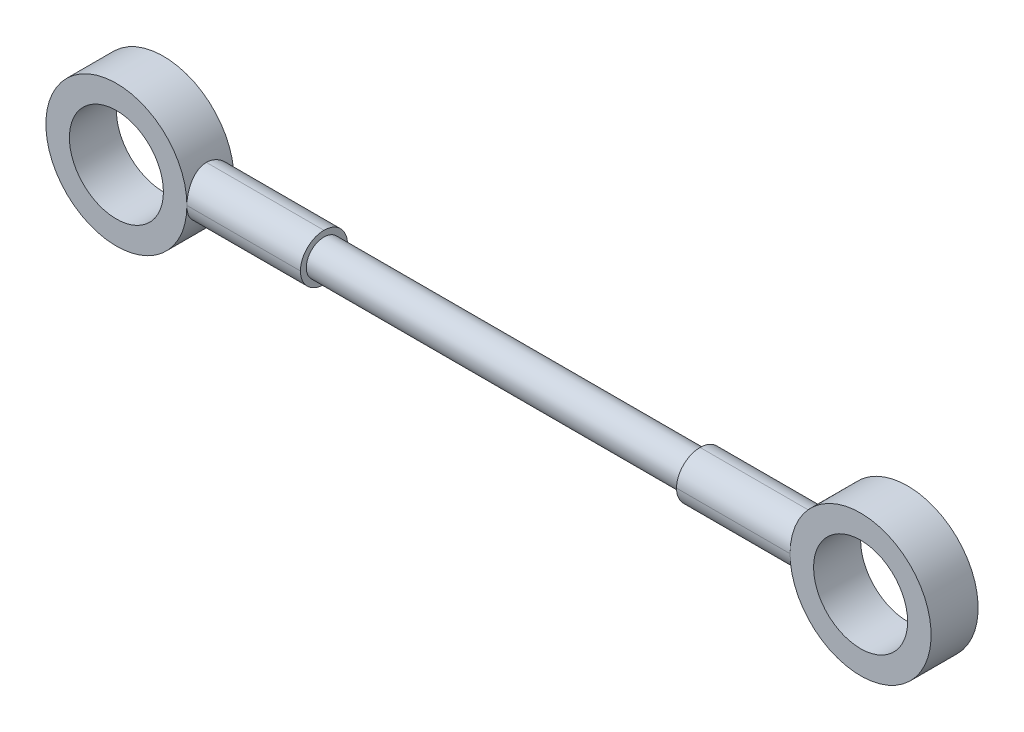
ISO-10303-21;
HEADER;
FILE_DESCRIPTION(('STEP AP214'),'2;1');
FILE_NAME('part.step','',(''),(''),'','','');
FILE_SCHEMA(('AUTOMOTIVE_DESIGN { 1 0 10303 214 1 1 1 1 }'));
ENDSEC;
DATA;
#1=APPLICATION_CONTEXT('core data for automotive mechanical design processes');
#2=APPLICATION_PROTOCOL_DEFINITION('international standard','automotive_design',2000,#1);
#3=PRODUCT_CONTEXT('',#1,'mechanical');
#4=PRODUCT('Part','Part','',(#3));
#5=PRODUCT_RELATED_PRODUCT_CATEGORY('part','',(#4));
#6=PRODUCT_DEFINITION_FORMATION('','',#4);
#7=PRODUCT_DEFINITION_CONTEXT('part definition',#1,'design');
#8=PRODUCT_DEFINITION('design','',#6,#7);
#9=PRODUCT_DEFINITION_SHAPE('','',#8);
#10=(LENGTH_UNIT() NAMED_UNIT(*) SI_UNIT(.MILLI.,.METRE.));
#11=(NAMED_UNIT(*) PLANE_ANGLE_UNIT() SI_UNIT($,.RADIAN.));
#12=(NAMED_UNIT(*) SI_UNIT($,.STERADIAN.) SOLID_ANGLE_UNIT());
#13=UNCERTAINTY_MEASURE_WITH_UNIT(LENGTH_MEASURE(1.E-05),#10,'distance_accuracy_value','');
#14=(GEOMETRIC_REPRESENTATION_CONTEXT(3) GLOBAL_UNCERTAINTY_ASSIGNED_CONTEXT((#13)) GLOBAL_UNIT_ASSIGNED_CONTEXT((#10,
#11,#12)) REPRESENTATION_CONTEXT('',''));
#15=CARTESIAN_POINT('',(0.,0.,0.));
#16=DIRECTION('',(0.,0.,1.));
#17=DIRECTION('',(1.,0.,0.));
#18=AXIS2_PLACEMENT_3D('',#15,#16,#17);
#19=CARTESIAN_POINT('',(-2.82842712474619,-1.,2.));
#20=DIRECTION('',(0.,0.,-1.));
#21=DIRECTION('',(-1.,0.,0.));
#22=AXIS2_PLACEMENT_3D('',#19,#20,#21);
#23=CYLINDRICAL_SURFACE('',#22,3.);
#24=CARTESIAN_POINT('',(-2.82842712474619,-1.,0.));
#25=DIRECTION('',(0.,0.,1.));
#26=DIRECTION('',(1.,0.,0.));
#27=AXIS2_PLACEMENT_3D('',#24,#25,#26);
#28=CIRCLE('',#27,3.);
#29=CARTESIAN_POINT('',(0.17157287525381,-1.,0.));
#30=VERTEX_POINT('',#29);
#31=EDGE_CURVE('E271',#30,#30,#28,.T.);
#32=ORIENTED_EDGE('',*,*,#31,.T.);
#33=CARTESIAN_POINT('',(0.17157287525381,-1.,0.));
#34=CARTESIAN_POINT('',(0.171574895683711,-1.0273341815832,-6.341255151472E-07));
#35=CARTESIAN_POINT('',(0.171198852653009,-1.05465458106806,0.00112146518805121));
#36=CARTESIAN_POINT('',(0.169712227509515,-1.10908622394521,0.00559256721422979));
#37=CARTESIAN_POINT('',(0.168601814056069,-1.13619751391667,0.00894105860296367));
#38=CARTESIAN_POINT('',(0.164211861163425,-1.21676717081039,0.0222664591395675));
#39=CARTESIAN_POINT('',(0.159873290123847,-1.26966401060743,0.0355236171974723));
#40=CARTESIAN_POINT('',(0.148826956569191,-1.3723325215028,0.0703168200425464));
#41=CARTESIAN_POINT('',(0.142120038917677,-1.42210529960458,0.091849912785915));
#42=CARTESIAN_POINT('',(0.127020134371075,-1.51735737488644,0.142531248358756));
#43=CARTESIAN_POINT('',(0.118626250326626,-1.56283436851799,0.171683545663462));
#44=CARTESIAN_POINT('',(0.1007142093334,-1.64974046928466,0.237824363219281));
#45=CARTESIAN_POINT('',(0.0911692651881778,-1.69100037422885,0.275027803593729));
#46=CARTESIAN_POINT('',(0.0721767808726406,-1.76682970187699,0.355763859637555));
#47=CARTESIAN_POINT('',(0.062729271088358,-1.80139709381649,0.399298389406312));
#48=CARTESIAN_POINT('',(0.0447028520329025,-1.86383672510256,0.493001776499649));
#49=CARTESIAN_POINT('',(0.0361572192253774,-1.89148486384565,0.543326827116039));
#50=CARTESIAN_POINT('',(0.0213207076682923,-1.93783407228994,0.648222653213277));
#51=CARTESIAN_POINT('',(0.0150274451238011,-1.95654460816169,0.702788865146815));
#52=CARTESIAN_POINT('',(0.00693350452697696,-1.98022444026411,0.797997384607047));
#53=CARTESIAN_POINT('',(0.00435463055334164,-1.9876210419263,0.837985516344999));
#54=CARTESIAN_POINT('',(0.000878301967788375,-1.99751591481272,0.918639741683267));
#55=CARTESIAN_POINT('',(-1.88930219856355E-05,-2.00001342970547,0.959305938987627));
#56=CARTESIAN_POINT('',(0.,-2.,1.));
#57=B_SPLINE_CURVE_WITH_KNOTS('',3,(#33,#34,#35,#36,#37,#38,#39,#40,#41,#42,#43,#44,#45,#46,#47,
#48,#49,#50,#51,#52,#53,#54,#55,#56),.UNSPECIFIED.,.F.,.F.,(4,2,2,2,2,2,2,2,2,2,2,4),(0.,
0.0819499502153417,0.163881085910289,0.327143353332599,0.490347438719014,0.653638548803994,
0.821992023758864,0.990396503807029,1.16370154745204,1.33682262759439,1.45874909491416,
1.58069438402141),.UNSPECIFIED.);
#58=CARTESIAN_POINT('',(0.,-2.,1.));
#59=VERTEX_POINT('',#58);
#60=EDGE_CURVE('E126',#30,#59,#57,.T.);
#61=ORIENTED_EDGE('',*,*,#60,.T.);
#62=CARTESIAN_POINT('',(0.,-2.,1.));
#63=CARTESIAN_POINT('',(-2.70452435684332E-06,-2.00000074756436,1.0272914781128));
#64=CARTESIAN_POINT('',(0.00039550302592743,-1.9988820440552,1.0545690248834));
#65=CARTESIAN_POINT('',(0.00196628915240177,-1.99442520677671,1.1089124836948));
#66=CARTESIAN_POINT('',(0.00313865858948704,-1.99108767242079,1.13597845089605));
#67=CARTESIAN_POINT('',(0.00776412497835064,-1.97780972353601,1.21639595058795));
#68=CARTESIAN_POINT('',(0.0123260080648277,-1.96460360313312,1.26918269340203));
#69=CARTESIAN_POINT('',(0.0238535189858551,-1.92995872747904,1.3716242745002));
#70=CARTESIAN_POINT('',(0.0308178637920714,-1.9085243658105,1.42128076777822));
#71=CARTESIAN_POINT('',(0.0463604431985569,-1.85807424130008,1.51633821762498));
#72=CARTESIAN_POINT('',(0.0549397250867303,-1.82905355394609,1.56173638387934));
#73=CARTESIAN_POINT('',(0.0731175608092314,-1.76305188825796,1.64871968071218));
#74=CARTESIAN_POINT('',(0.0827413941457665,-1.72582622035046,1.69011381458293));
#75=CARTESIAN_POINT('',(0.101711161410165,-1.64498916323806,1.76620523841994));
#76=CARTESIAN_POINT('',(0.111057038796944,-1.60137648534903,1.80090117363182));
#77=CARTESIAN_POINT('',(0.128714467347506,-1.50758974235876,1.86348941937963));
#78=CARTESIAN_POINT('',(0.136992173141851,-1.45727278199338,1.89117778867313));
#79=CARTESIAN_POINT('',(0.15127321622625,-1.35238919133199,1.93760527679002));
#80=CARTESIAN_POINT('',(0.157278696192476,-1.29782662342825,1.95635283104096));
#81=CARTESIAN_POINT('',(0.164991067433952,-1.20251996913543,1.98012275152827));
#82=CARTESIAN_POINT('',(0.167442343934031,-1.16242206859112,1.98755876778259));
#83=CARTESIAN_POINT('',(0.170740824616526,-1.08155816921847,1.99750386175675));
#84=CARTESIAN_POINT('',(0.171588097798374,-1.04079219920457,2.00001315140983));
#85=CARTESIAN_POINT('',(0.17157287525381,-1.,2.));
#86=B_SPLINE_CURVE_WITH_KNOTS('',3,(#62,#63,#64,#65,#66,#67,#68,#69,#70,#71,#72,#73,#74,#75,#76,
#77,#78,#79,#80,#81,#82,#83,#84,#85),.UNSPECIFIED.,.F.,.F.,(4,2,2,2,2,2,2,2,2,2,2,4),(0.,
0.0818214261370687,0.163620757330831,0.32658121417332,0.489454776800649,0.652434329231453,
0.82116302655375,0.989925814684785,1.16314675188847,1.33620393471117,1.45845203884751,
1.58069488411601),.UNSPECIFIED.);
#87=CARTESIAN_POINT('',(0.17157287525381,-1.,2.));
#88=VERTEX_POINT('',#87);
#89=EDGE_CURVE('E218',#59,#88,#86,.T.);
#90=ORIENTED_EDGE('',*,*,#89,.T.);
#91=CARTESIAN_POINT('',(-2.82842712474619,-1.,2.));
#92=DIRECTION('',(0.,0.,1.));
#93=DIRECTION('',(1.,0.,0.));
#94=AXIS2_PLACEMENT_3D('',#91,#92,#93);
#95=CIRCLE('',#94,3.);
#96=EDGE_CURVE('E265',#88,#88,#95,.T.);
#97=ORIENTED_EDGE('',*,*,#96,.F.);
#98=CARTESIAN_POINT('',(0.17157287525381,-1.,2.));
#99=CARTESIAN_POINT('',(0.171574895683711,-0.9726658184168,2.00000063412552));
#100=CARTESIAN_POINT('',(0.171198852653009,-0.945345418931944,1.99887853481195));
#101=CARTESIAN_POINT('',(0.169712227509516,-0.890913776054792,1.99440743278577));
#102=CARTESIAN_POINT('',(0.168601814056069,-0.863802486083335,1.99105894139704));
#103=CARTESIAN_POINT('',(0.164211861163425,-0.783232829189608,1.97773354086043));
#104=CARTESIAN_POINT('',(0.159873290123847,-0.730335989392572,1.96447638280253));
#105=CARTESIAN_POINT('',(0.148826956569191,-0.627667478497201,1.92968317995745));
#106=CARTESIAN_POINT('',(0.142120038917677,-0.577894700395424,1.90815008721409));
#107=CARTESIAN_POINT('',(0.127020134371075,-0.48264262511356,1.85746875164124));
#108=CARTESIAN_POINT('',(0.118626250326625,-0.437165631482007,1.82831645433654));
#109=CARTESIAN_POINT('',(0.100714209333399,-0.350259530715338,1.76217563678072));
#110=CARTESIAN_POINT('',(0.0911692651881778,-0.308999625771145,1.72497219640627));
#111=CARTESIAN_POINT('',(0.0721767808726406,-0.233170298123015,1.64423614036245));
#112=CARTESIAN_POINT('',(0.0627292710883576,-0.198602906183507,1.60070161059369));
#113=CARTESIAN_POINT('',(0.0447028520329021,-0.136163274897442,1.50699822350035));
#114=CARTESIAN_POINT('',(0.0361572192253773,-0.10851513615435,1.45667317288396));
#115=CARTESIAN_POINT('',(0.0213207076682922,-0.0621659277100603,1.35177734678672));
#116=CARTESIAN_POINT('',(0.0150274451238007,-0.0434553918383099,1.29721113485319));
#117=CARTESIAN_POINT('',(0.00693350452697641,-0.0197755597358865,1.20200261539295));
#118=CARTESIAN_POINT('',(0.00435463055334112,-0.0123789580736969,1.162014483655));
#119=CARTESIAN_POINT('',(0.000878301967788045,-0.00248408518727784,1.08136025831673));
#120=CARTESIAN_POINT('',(-1.8893021985806E-05,1.34297054719161E-05,1.04069406101237));
#121=CARTESIAN_POINT('',(0.,0.,1.));
#122=B_SPLINE_CURVE_WITH_KNOTS('',3,(#98,#99,#100,#101,#102,#103,#104,#105,#106,#107,#108,#109,
#110,#111,#112,#113,#114,#115,#116,#117,#118,#119,#120,#121),.UNSPECIFIED.,.F.,.F.,(4,2,2,2,2,2,
2,2,2,2,2,4),(0.,0.0819499502153415,0.163881085910288,0.327143353332599,0.490347438719014,
0.653638548803994,0.821992023758864,0.990396503807029,1.16370154745204,1.33682262759439,
1.45874909491416,1.58069438402141),.UNSPECIFIED.);
#123=CARTESIAN_POINT('',(0.,0.,1.));
#124=VERTEX_POINT('',#123);
#125=EDGE_CURVE('E139',#88,#124,#122,.T.);
#126=ORIENTED_EDGE('',*,*,#125,.T.);
#127=CARTESIAN_POINT('',(0.,0.,1.));
#128=CARTESIAN_POINT('',(-2.70452435728408E-06,7.47564359590601E-07,0.972708521887199));
#129=CARTESIAN_POINT('',(0.000395503025926949,-0.00111795594480098,0.945430975116602));
#130=CARTESIAN_POINT('',(0.00196628915240149,-0.00557479322329393,0.891087516305198));
#131=CARTESIAN_POINT('',(0.003138658589487,-0.00891232757921084,0.864021549103947));
#132=CARTESIAN_POINT('',(0.00776412497835097,-0.0221902764639867,0.783604049412054));
#133=CARTESIAN_POINT('',(0.0123260080648278,-0.0353963968668777,0.730817306597974));
#134=CARTESIAN_POINT('',(0.023853518985855,-0.0700412725209598,0.628375725499801));
#135=CARTESIAN_POINT('',(0.0308178637920713,-0.091475634189501,0.578719232221779));
#136=CARTESIAN_POINT('',(0.0463604431985568,-0.141925758699916,0.483661782375017));
#137=CARTESIAN_POINT('',(0.0549397250867303,-0.170946446053912,0.438263616120662));
#138=CARTESIAN_POINT('',(0.0731175608092314,-0.236948111742035,0.351280319287816));
#139=CARTESIAN_POINT('',(0.0827413941457665,-0.274173779649543,0.309886185417069));
#140=CARTESIAN_POINT('',(0.101711161410165,-0.355010836761935,0.233794761580061));
#141=CARTESIAN_POINT('',(0.111057038796944,-0.398623514650966,0.199098826368183));
#142=CARTESIAN_POINT('',(0.128714467347505,-0.492410257641237,0.136510580620371));
#143=CARTESIAN_POINT('',(0.136992173141851,-0.542727218006621,0.108822211326867));
#144=CARTESIAN_POINT('',(0.15127321622625,-0.64761080866801,0.0623947232099815));
#145=CARTESIAN_POINT('',(0.157278696192476,-0.702173376571753,0.0436471689590383));
#146=CARTESIAN_POINT('',(0.164991067433952,-0.797480030864567,0.0198772484717253));
#147=CARTESIAN_POINT('',(0.167442343934031,-0.837577931408877,0.0124412322174104));
#148=CARTESIAN_POINT('',(0.170740824616526,-0.918441830781532,0.00249613824325099));
#149=CARTESIAN_POINT('',(0.171588097798374,-0.959207800795427,-1.31514098298327E-05));
#150=CARTESIAN_POINT('',(0.17157287525381,-1.,0.));
#151=B_SPLINE_CURVE_WITH_KNOTS('',3,(#127,#128,#129,#130,#131,#132,#133,#134,#135,#136,#137,
#138,#139,#140,#141,#142,#143,#144,#145,#146,#147,#148,#149,#150),.UNSPECIFIED.,.F.,.F.,(4,2,2,
2,2,2,2,2,2,2,2,4),(0.,0.0818214261370686,0.163620757330831,0.32658121417332,0.489454776800649,
0.652434329231454,0.82116302655375,0.989925814684785,1.16314675188847,1.33620393471117,
1.45845203884751,1.58069488411601),.UNSPECIFIED.);
#152=EDGE_CURVE('E233',#124,#30,#151,.T.);
#153=ORIENTED_EDGE('',*,*,#152,.T.);
#154=EDGE_LOOP('',(#32,#61,#90,#97,#126,#153));
#155=FACE_BOUND('',#154,.T.);
#156=ADVANCED_FACE('F34',(#155),#23,.T.);
#157=CARTESIAN_POINT('',(5.,0.,2.));
#158=DIRECTION('',(-1.,0.,0.));
#159=DIRECTION('',(0.,0.,1.));
#160=AXIS2_PLACEMENT_3D('',#157,#158,#159);
#161=PLANE('',#160);
#162=CARTESIAN_POINT('',(5.,-1.,1.));
#163=DIRECTION('',(1.,0.,0.));
#164=DIRECTION('',(0.,0.,-1.));
#165=AXIS2_PLACEMENT_3D('',#162,#163,#164);
#166=CIRCLE('',#165,0.75);
#167=CARTESIAN_POINT('',(5.,-1.,0.25));
#168=VERTEX_POINT('',#167);
#169=EDGE_CURVE('E262',#168,#168,#166,.T.);
#170=ORIENTED_EDGE('',*,*,#169,.F.);
#171=EDGE_LOOP('',(#170));
#172=FACE_BOUND('',#171,.T.);
#173=CARTESIAN_POINT('',(5.,-1.,1.));
#174=DIRECTION('',(-1.,0.,0.));
#175=DIRECTION('',(0.,0.,1.));
#176=AXIS2_PLACEMENT_3D('',#173,#174,#175);
#177=CIRCLE('',#176,1.);
#178=CARTESIAN_POINT('',(5.,0.,1.));
#179=VERTEX_POINT('',#178);
#180=CARTESIAN_POINT('',(5.,-1.,2.));
#181=VERTEX_POINT('',#180);
#182=EDGE_CURVE('E123',#179,#181,#177,.F.);
#183=ORIENTED_EDGE('',*,*,#182,.T.);
#184=CARTESIAN_POINT('',(5.,-1.,1.));
#185=DIRECTION('',(-1.,0.,0.));
#186=DIRECTION('',(0.,0.,1.));
#187=AXIS2_PLACEMENT_3D('',#184,#185,#186);
#188=CIRCLE('',#187,1.);
#189=CARTESIAN_POINT('',(5.,-2.,1.));
#190=VERTEX_POINT('',#189);
#191=EDGE_CURVE('E109',#181,#190,#188,.F.);
#192=ORIENTED_EDGE('',*,*,#191,.T.);
#193=CARTESIAN_POINT('',(5.,-1.,1.));
#194=DIRECTION('',(-1.,0.,0.));
#195=DIRECTION('',(0.,0.,1.));
#196=AXIS2_PLACEMENT_3D('',#193,#194,#195);
#197=CIRCLE('',#196,1.);
#198=CARTESIAN_POINT('',(5.,-1.,0.));
#199=VERTEX_POINT('',#198);
#200=EDGE_CURVE('E103',#190,#199,#197,.F.);
#201=ORIENTED_EDGE('',*,*,#200,.T.);
#202=CARTESIAN_POINT('',(5.,-1.,1.));
#203=DIRECTION('',(-1.,0.,0.));
#204=DIRECTION('',(0.,0.,1.));
#205=AXIS2_PLACEMENT_3D('',#202,#203,#204);
#206=CIRCLE('',#205,1.);
#207=EDGE_CURVE('E106',#199,#179,#206,.F.);
#208=ORIENTED_EDGE('',*,*,#207,.T.);
#209=EDGE_LOOP('',(#183,#192,#201,#208));
#210=FACE_BOUND('',#209,.T.);
#211=ADVANCED_FACE('F105',(#172,#210),#161,.F.);
#212=CARTESIAN_POINT('',(-2.82842712474619,-1.,2.));
#213=DIRECTION('',(0.,0.,1.));
#214=DIRECTION('',(1.,0.,0.));
#215=AXIS2_PLACEMENT_3D('',#212,#213,#214);
#216=PLANE('',#215);
#217=CARTESIAN_POINT('',(-2.82842712474619,-1.,2.));
#218=DIRECTION('',(0.,0.,1.));
#219=DIRECTION('',(1.,0.,0.));
#220=AXIS2_PLACEMENT_3D('',#217,#218,#219);
#221=CIRCLE('',#220,2.);
#222=CARTESIAN_POINT('',(-0.82842712474619,-1.,2.));
#223=VERTEX_POINT('',#222);
#224=EDGE_CURVE('E289',#223,#223,#221,.T.);
#225=ORIENTED_EDGE('',*,*,#224,.F.);
#226=EDGE_LOOP('',(#225));
#227=FACE_BOUND('',#226,.T.);
#228=ORIENTED_EDGE('',*,*,#96,.T.);
#229=EDGE_LOOP('',(#228));
#230=FACE_BOUND('',#229,.T.);
#231=ADVANCED_FACE('F205',(#227,#230),#216,.T.);
#232=CARTESIAN_POINT('',(-2.82842712474619,-1.,0.));
#233=DIRECTION('',(0.,0.,1.));
#234=DIRECTION('',(1.,0.,0.));
#235=AXIS2_PLACEMENT_3D('',#232,#233,#234);
#236=PLANE('',#235);
#237=CARTESIAN_POINT('',(-2.82842712474619,-1.,0.));
#238=DIRECTION('',(0.,0.,1.));
#239=DIRECTION('',(1.,0.,0.));
#240=AXIS2_PLACEMENT_3D('',#237,#238,#239);
#241=CIRCLE('',#240,2.);
#242=CARTESIAN_POINT('',(-0.82842712474619,-1.,0.));
#243=VERTEX_POINT('',#242);
#244=EDGE_CURVE('E295',#243,#243,#241,.T.);
#245=ORIENTED_EDGE('',*,*,#244,.T.);
#246=EDGE_LOOP('',(#245));
#247=FACE_BOUND('',#246,.T.);
#248=ORIENTED_EDGE('',*,*,#31,.F.);
#249=EDGE_LOOP('',(#248));
#250=FACE_BOUND('',#249,.T.);
#251=ADVANCED_FACE('F302',(#247,#250),#236,.F.);
#252=CARTESIAN_POINT('',(25.,-1.,1.));
#253=DIRECTION('',(-1.,0.,0.));
#254=DIRECTION('',(0.,0.,1.));
#255=AXIS2_PLACEMENT_3D('',#252,#253,#254);
#256=CYLINDRICAL_SURFACE('',#255,0.75);
#257=CARTESIAN_POINT('',(21.,-1.,1.));
#258=DIRECTION('',(-1.,0.,0.));
#259=DIRECTION('',(0.,0.,1.));
#260=AXIS2_PLACEMENT_3D('',#257,#258,#259);
#261=CIRCLE('',#260,0.75);
#262=CARTESIAN_POINT('',(21.,-1.,1.75));
#263=VERTEX_POINT('',#262);
#264=EDGE_CURVE('E268',#263,#263,#261,.T.);
#265=ORIENTED_EDGE('',*,*,#264,.T.);
#266=EDGE_LOOP('',(#265));
#267=FACE_BOUND('',#266,.T.);
#268=ORIENTED_EDGE('',*,*,#169,.T.);
#269=EDGE_LOOP('',(#268));
#270=FACE_BOUND('',#269,.T.);
#271=ADVANCED_FACE('F306',(#267,#270),#256,.T.);
#272=CARTESIAN_POINT('',(-2.82842712474619,-1.,-18.));
#273=DIRECTION('',(0.,0.,1.));
#274=DIRECTION('',(1.,0.,0.));
#275=AXIS2_PLACEMENT_3D('',#272,#273,#274);
#276=CYLINDRICAL_SURFACE('',#275,2.);
#277=ORIENTED_EDGE('',*,*,#224,.T.);
#278=EDGE_LOOP('',(#277));
#279=FACE_BOUND('',#278,.T.);
#280=ORIENTED_EDGE('',*,*,#244,.F.);
#281=EDGE_LOOP('',(#280));
#282=FACE_BOUND('',#281,.T.);
#283=ADVANCED_FACE('F171',(#279,#282),#276,.F.);
#284=CARTESIAN_POINT('',(28.8284271247462,-1.,2.));
#285=DIRECTION('',(0.,0.,-1.));
#286=DIRECTION('',(-1.,0.,0.));
#287=AXIS2_PLACEMENT_3D('',#284,#285,#286);
#288=CYLINDRICAL_SURFACE('',#287,3.);
#289=CARTESIAN_POINT('',(28.8284271247462,-1.,0.));
#290=DIRECTION('',(0.,0.,-1.));
#291=DIRECTION('',(-1.,0.,0.));
#292=AXIS2_PLACEMENT_3D('',#289,#290,#291);
#293=CIRCLE('',#292,3.);
#294=CARTESIAN_POINT('',(25.8284271247462,-1.,0.));
#295=VERTEX_POINT('',#294);
#296=EDGE_CURVE('E286',#295,#295,#293,.T.);
#297=ORIENTED_EDGE('',*,*,#296,.F.);
#298=CARTESIAN_POINT('',(25.8284271247462,-1.,0.));
#299=CARTESIAN_POINT('',(25.8284251043163,-0.9726658184168,-6.3412551510095E-07));
#300=CARTESIAN_POINT('',(25.828801147347,-0.945345418931944,0.00112146518805129));
#301=CARTESIAN_POINT('',(25.8302877724905,-0.890913776054792,0.00559256721422988));
#302=CARTESIAN_POINT('',(25.8313981859439,-0.863802486083335,0.00894105860296376));
#303=CARTESIAN_POINT('',(25.8357881388366,-0.783232829189607,0.0222664591395676));
#304=CARTESIAN_POINT('',(25.8401267098762,-0.730335989392572,0.0355236171974724));
#305=CARTESIAN_POINT('',(25.8511730434308,-0.627667478497201,0.0703168200425463));
#306=CARTESIAN_POINT('',(25.8578799610823,-0.577894700395424,0.0918499127859149));
#307=CARTESIAN_POINT('',(25.8729798656289,-0.48264262511356,0.142531248358756));
#308=CARTESIAN_POINT('',(25.8813737496734,-0.437165631482006,0.171683545663462));
#309=CARTESIAN_POINT('',(25.8992857906666,-0.350259530715337,0.237824363219281));
#310=CARTESIAN_POINT('',(25.9088307348118,-0.308999625771145,0.275027803593729));
#311=CARTESIAN_POINT('',(25.9278232191274,-0.233170298123014,0.355763859637555));
#312=CARTESIAN_POINT('',(25.9372707289116,-0.198602906183507,0.399298389406312));
#313=CARTESIAN_POINT('',(25.9552971479671,-0.136163274897442,0.493001776499649));
#314=CARTESIAN_POINT('',(25.9638427807746,-0.10851513615435,0.543326827116038));
#315=CARTESIAN_POINT('',(25.9786792923317,-0.0621659277100602,0.648222653213277));
#316=CARTESIAN_POINT('',(25.9849725548762,-0.0434553918383099,0.702788865146815));
#317=CARTESIAN_POINT('',(25.993066495473,-0.0197755597358865,0.797997384607048));
#318=CARTESIAN_POINT('',(25.9956453694467,-0.012378958073697,0.837985516344999));
#319=CARTESIAN_POINT('',(25.9991216980322,-0.0024840851872779,0.918639741683266));
#320=CARTESIAN_POINT('',(26.000018893022,1.34297054718613E-05,0.959305938987627));
#321=CARTESIAN_POINT('',(26.,0.,1.));
#322=B_SPLINE_CURVE_WITH_KNOTS('',3,(#298,#299,#300,#301,#302,#303,#304,#305,#306,#307,#308,
#309,#310,#311,#312,#313,#314,#315,#316,#317,#318,#319,#320,#321),.UNSPECIFIED.,.F.,.F.,(4,2,2,
2,2,2,2,2,2,2,2,4),(0.,0.0819499502153416,0.163881085910288,0.3271433533326,0.490347438719014,
0.653638548803995,0.821992023758864,0.990396503807029,1.16370154745204,1.33682262759439,
1.45874909491416,1.58069438402141),.UNSPECIFIED.);
#323=CARTESIAN_POINT('',(26.,0.,1.));
#324=VERTEX_POINT('',#323);
#325=EDGE_CURVE('E44',#295,#324,#322,.T.);
#326=ORIENTED_EDGE('',*,*,#325,.T.);
#327=CARTESIAN_POINT('',(26.,0.,1.));
#328=CARTESIAN_POINT('',(26.0000027045244,7.47564359528526E-07,1.0272914781128));
#329=CARTESIAN_POINT('',(25.9996044969741,-0.00111795594480098,1.0545690248834));
#330=CARTESIAN_POINT('',(25.9980337108476,-0.00557479322329378,1.1089124836948));
#331=CARTESIAN_POINT('',(25.9968613414105,-0.00891232757921058,1.13597845089605));
#332=CARTESIAN_POINT('',(25.9922358750216,-0.0221902764639864,1.21639595058795));
#333=CARTESIAN_POINT('',(25.9876739919352,-0.0353963968668776,1.26918269340203));
#334=CARTESIAN_POINT('',(25.9761464810141,-0.0700412725209599,1.3716242745002));
#335=CARTESIAN_POINT('',(25.9691821362079,-0.091475634189501,1.42128076777822));
#336=CARTESIAN_POINT('',(25.9536395568014,-0.141925758699916,1.51633821762498));
#337=CARTESIAN_POINT('',(25.9450602749133,-0.170946446053912,1.56173638387934));
#338=CARTESIAN_POINT('',(25.9268824391908,-0.236948111742036,1.64871968071218));
#339=CARTESIAN_POINT('',(25.9172586058542,-0.274173779649544,1.69011381458293));
#340=CARTESIAN_POINT('',(25.8982888385898,-0.355010836761935,1.76620523841994));
#341=CARTESIAN_POINT('',(25.8889429612031,-0.398623514650966,1.80090117363182));
#342=CARTESIAN_POINT('',(25.8712855326525,-0.492410257641238,1.86348941937963));
#343=CARTESIAN_POINT('',(25.8630078268581,-0.542727218006622,1.89117778867313));
#344=CARTESIAN_POINT('',(25.8487267837737,-0.64761080866801,1.93760527679002));
#345=CARTESIAN_POINT('',(25.8427213038075,-0.702173376571753,1.95635283104096));
#346=CARTESIAN_POINT('',(25.835008932566,-0.797480030864567,1.98012275152827));
#347=CARTESIAN_POINT('',(25.832557656066,-0.837577931408877,1.98755876778259));
#348=CARTESIAN_POINT('',(25.8292591753835,-0.918441830781531,1.99750386175675));
#349=CARTESIAN_POINT('',(25.8284119022016,-0.959207800795427,2.00001315140983));
#350=CARTESIAN_POINT('',(25.8284271247462,-1.,2.));
#351=B_SPLINE_CURVE_WITH_KNOTS('',3,(#327,#328,#329,#330,#331,#332,#333,#334,#335,#336,#337,
#338,#339,#340,#341,#342,#343,#344,#345,#346,#347,#348,#349,#350),.UNSPECIFIED.,.F.,.F.,(4,2,2,
2,2,2,2,2,2,2,2,4),(0.,0.0818214261370685,0.163620757330831,0.32658121417332,0.489454776800649,
0.652434329231454,0.82116302655375,0.989925814684785,1.16314675188847,1.33620393471117,
1.45845203884751,1.58069488411601),.UNSPECIFIED.);
#352=CARTESIAN_POINT('',(25.8284271247462,-1.,2.));
#353=VERTEX_POINT('',#352);
#354=EDGE_CURVE('E11',#324,#353,#351,.T.);
#355=ORIENTED_EDGE('',*,*,#354,.T.);
#356=CARTESIAN_POINT('',(28.8284271247462,-1.,2.));
#357=DIRECTION('',(0.,0.,-1.));
#358=DIRECTION('',(-1.,0.,0.));
#359=AXIS2_PLACEMENT_3D('',#356,#357,#358);
#360=CIRCLE('',#359,3.);
#361=EDGE_CURVE('E284',#353,#353,#360,.T.);
#362=ORIENTED_EDGE('',*,*,#361,.T.);
#363=CARTESIAN_POINT('',(25.8284271247462,-1.,2.));
#364=CARTESIAN_POINT('',(25.8284251043163,-1.0273341815832,2.00000063412552));
#365=CARTESIAN_POINT('',(25.828801147347,-1.05465458106806,1.99887853481195));
#366=CARTESIAN_POINT('',(25.8302877724905,-1.10908622394521,1.99440743278577));
#367=CARTESIAN_POINT('',(25.8313981859439,-1.13619751391667,1.99105894139704));
#368=CARTESIAN_POINT('',(25.8357881388366,-1.21676717081039,1.97773354086043));
#369=CARTESIAN_POINT('',(25.8401267098762,-1.26966401060743,1.96447638280253));
#370=CARTESIAN_POINT('',(25.8511730434308,-1.3723325215028,1.92968317995745));
#371=CARTESIAN_POINT('',(25.8578799610823,-1.42210529960458,1.90815008721409));
#372=CARTESIAN_POINT('',(25.8729798656289,-1.51735737488644,1.85746875164124));
#373=CARTESIAN_POINT('',(25.8813737496734,-1.56283436851799,1.82831645433654));
#374=CARTESIAN_POINT('',(25.8992857906666,-1.64974046928466,1.76217563678072));
#375=CARTESIAN_POINT('',(25.9088307348118,-1.69100037422885,1.72497219640627));
#376=CARTESIAN_POINT('',(25.9278232191274,-1.76682970187699,1.64423614036245));
#377=CARTESIAN_POINT('',(25.9372707289116,-1.80139709381649,1.60070161059369));
#378=CARTESIAN_POINT('',(25.9552971479671,-1.86383672510256,1.50699822350035));
#379=CARTESIAN_POINT('',(25.9638427807746,-1.89148486384565,1.45667317288396));
#380=CARTESIAN_POINT('',(25.9786792923317,-1.93783407228994,1.35177734678672));
#381=CARTESIAN_POINT('',(25.9849725548762,-1.95654460816169,1.29721113485318));
#382=CARTESIAN_POINT('',(25.993066495473,-1.98022444026411,1.20200261539295));
#383=CARTESIAN_POINT('',(25.9956453694467,-1.9876210419263,1.162014483655));
#384=CARTESIAN_POINT('',(25.9991216980322,-1.99751591481272,1.08136025831673));
#385=CARTESIAN_POINT('',(26.000018893022,-2.00001342970547,1.04069406101237));
#386=CARTESIAN_POINT('',(26.,-2.,1.));
#387=B_SPLINE_CURVE_WITH_KNOTS('',3,(#363,#364,#365,#366,#367,#368,#369,#370,#371,#372,#373,
#374,#375,#376,#377,#378,#379,#380,#381,#382,#383,#384,#385,#386),.UNSPECIFIED.,.F.,.F.,(4,2,2,
2,2,2,2,2,2,2,2,4),(0.,0.0819499502153415,0.163881085910288,0.3271433533326,0.490347438719014,
0.653638548803995,0.821992023758864,0.990396503807029,1.16370154745204,1.33682262759439,
1.45874909491416,1.58069438402141),.UNSPECIFIED.);
#388=CARTESIAN_POINT('',(26.,-2.,1.));
#389=VERTEX_POINT('',#388);
#390=EDGE_CURVE('E146',#353,#389,#387,.T.);
#391=ORIENTED_EDGE('',*,*,#390,.T.);
#392=CARTESIAN_POINT('',(26.,-2.,1.));
#393=CARTESIAN_POINT('',(26.0000027045244,-2.00000074756436,0.972708521887199));
#394=CARTESIAN_POINT('',(25.9996044969741,-1.9988820440552,0.945430975116602));
#395=CARTESIAN_POINT('',(25.9980337108476,-1.99442520677671,0.891087516305198));
#396=CARTESIAN_POINT('',(25.9968613414105,-1.99108767242079,0.864021549103948));
#397=CARTESIAN_POINT('',(25.9922358750216,-1.97780972353601,0.783604049412054));
#398=CARTESIAN_POINT('',(25.9876739919352,-1.96460360313312,0.730817306597974));
#399=CARTESIAN_POINT('',(25.9761464810141,-1.92995872747904,0.628375725499801));
#400=CARTESIAN_POINT('',(25.9691821362079,-1.9085243658105,0.578719232221779));
#401=CARTESIAN_POINT('',(25.9536395568014,-1.85807424130008,0.483661782375017));
#402=CARTESIAN_POINT('',(25.9450602749133,-1.82905355394609,0.438263616120662));
#403=CARTESIAN_POINT('',(25.9268824391908,-1.76305188825796,0.351280319287816));
#404=CARTESIAN_POINT('',(25.9172586058542,-1.72582622035046,0.30988618541707));
#405=CARTESIAN_POINT('',(25.8982888385898,-1.64498916323807,0.233794761580061));
#406=CARTESIAN_POINT('',(25.8889429612031,-1.60137648534903,0.199098826368183));
#407=CARTESIAN_POINT('',(25.8712855326525,-1.50758974235876,0.136510580620371));
#408=CARTESIAN_POINT('',(25.8630078268581,-1.45727278199338,0.108822211326867));
#409=CARTESIAN_POINT('',(25.8487267837737,-1.35238919133199,0.0623947232099818));
#410=CARTESIAN_POINT('',(25.8427213038075,-1.29782662342825,0.0436471689590387));
#411=CARTESIAN_POINT('',(25.835008932566,-1.20251996913543,0.0198772484717255));
#412=CARTESIAN_POINT('',(25.832557656066,-1.16242206859112,0.0124412322174105));
#413=CARTESIAN_POINT('',(25.8292591753835,-1.08155816921847,0.00249613824325094));
#414=CARTESIAN_POINT('',(25.8284119022016,-1.04079219920457,-1.31514098299325E-05));
#415=CARTESIAN_POINT('',(25.8284271247462,-1.,0.));
#416=B_SPLINE_CURVE_WITH_KNOTS('',3,(#392,#393,#394,#395,#396,#397,#398,#399,#400,#401,#402,
#403,#404,#405,#406,#407,#408,#409,#410,#411,#412,#413,#414,#415),.UNSPECIFIED.,.F.,.F.,(4,2,2,
2,2,2,2,2,2,2,2,4),(0.,0.0818214261370686,0.163620757330831,0.32658121417332,0.48945477680065,
0.652434329231453,0.821163026553749,0.989925814684784,1.16314675188847,1.33620393471117,
1.45845203884751,1.58069488411601),.UNSPECIFIED.);
#417=EDGE_CURVE('E155',#389,#295,#416,.T.);
#418=ORIENTED_EDGE('',*,*,#417,.T.);
#419=EDGE_LOOP('',(#297,#326,#355,#362,#391,#418));
#420=FACE_BOUND('',#419,.T.);
#421=ADVANCED_FACE('F165',(#420),#288,.T.);
#422=CARTESIAN_POINT('',(21.,0.,2.));
#423=DIRECTION('',(-1.,0.,0.));
#424=DIRECTION('',(0.,0.,1.));
#425=AXIS2_PLACEMENT_3D('',#422,#423,#424);
#426=PLANE('',#425);
#427=ORIENTED_EDGE('',*,*,#264,.F.);
#428=EDGE_LOOP('',(#427));
#429=FACE_BOUND('',#428,.T.);
#430=CARTESIAN_POINT('',(21.,-1.,1.));
#431=DIRECTION('',(-1.,0.,0.));
#432=DIRECTION('',(0.,0.,1.));
#433=AXIS2_PLACEMENT_3D('',#430,#431,#432);
#434=CIRCLE('',#433,1.);
#435=CARTESIAN_POINT('',(21.,-1.,0.));
#436=VERTEX_POINT('',#435);
#437=CARTESIAN_POINT('',(21.,-2.,1.));
#438=VERTEX_POINT('',#437);
#439=EDGE_CURVE('E141',#436,#438,#434,.T.);
#440=ORIENTED_EDGE('',*,*,#439,.T.);
#441=CARTESIAN_POINT('',(21.,-1.,1.));
#442=DIRECTION('',(-1.,0.,0.));
#443=DIRECTION('',(0.,0.,1.));
#444=AXIS2_PLACEMENT_3D('',#441,#442,#443);
#445=CIRCLE('',#444,1.);
#446=CARTESIAN_POINT('',(21.,-1.,2.));
#447=VERTEX_POINT('',#446);
#448=EDGE_CURVE('E143',#438,#447,#445,.T.);
#449=ORIENTED_EDGE('',*,*,#448,.T.);
#450=CARTESIAN_POINT('',(21.,-1.,1.));
#451=DIRECTION('',(-1.,0.,0.));
#452=DIRECTION('',(0.,0.,1.));
#453=AXIS2_PLACEMENT_3D('',#450,#451,#452);
#454=CIRCLE('',#453,1.);
#455=CARTESIAN_POINT('',(21.,0.,1.));
#456=VERTEX_POINT('',#455);
#457=EDGE_CURVE('E136',#447,#456,#454,.T.);
#458=ORIENTED_EDGE('',*,*,#457,.T.);
#459=CARTESIAN_POINT('',(21.,-1.,1.));
#460=DIRECTION('',(-1.,0.,0.));
#461=DIRECTION('',(0.,0.,1.));
#462=AXIS2_PLACEMENT_3D('',#459,#460,#461);
#463=CIRCLE('',#462,1.);
#464=EDGE_CURVE('E138',#456,#436,#463,.T.);
#465=ORIENTED_EDGE('',*,*,#464,.T.);
#466=EDGE_LOOP('',(#440,#449,#458,#465));
#467=FACE_BOUND('',#466,.T.);
#468=ADVANCED_FACE('F170',(#429,#467),#426,.T.);
#469=CARTESIAN_POINT('',(28.8284271247462,-1.,2.));
#470=DIRECTION('',(0.,0.,1.));
#471=DIRECTION('',(-1.,0.,0.));
#472=AXIS2_PLACEMENT_3D('',#469,#470,#471);
#473=PLANE('',#472);
#474=CARTESIAN_POINT('',(28.8284271247462,-1.,2.));
#475=DIRECTION('',(0.,0.,1.));
#476=DIRECTION('',(1.,0.,0.));
#477=AXIS2_PLACEMENT_3D('',#474,#475,#476);
#478=CIRCLE('',#477,2.);
#479=CARTESIAN_POINT('',(30.8284271247462,-1.,2.));
#480=VERTEX_POINT('',#479);
#481=EDGE_CURVE('E130',#480,#480,#478,.T.);
#482=ORIENTED_EDGE('',*,*,#481,.F.);
#483=EDGE_LOOP('',(#482));
#484=FACE_BOUND('',#483,.T.);
#485=ORIENTED_EDGE('',*,*,#361,.F.);
#486=EDGE_LOOP('',(#485));
#487=FACE_BOUND('',#486,.T.);
#488=ADVANCED_FACE('F396',(#484,#487),#473,.T.);
#489=CARTESIAN_POINT('',(28.8284271247462,-1.,0.));
#490=DIRECTION('',(0.,0.,1.));
#491=DIRECTION('',(-1.,0.,0.));
#492=AXIS2_PLACEMENT_3D('',#489,#490,#491);
#493=PLANE('',#492);
#494=CARTESIAN_POINT('',(28.8284271247462,-1.,0.));
#495=DIRECTION('',(0.,0.,-1.));
#496=DIRECTION('',(-1.,0.,0.));
#497=AXIS2_PLACEMENT_3D('',#494,#495,#496);
#498=CIRCLE('',#497,2.);
#499=CARTESIAN_POINT('',(26.8284271247462,-1.,0.));
#500=VERTEX_POINT('',#499);
#501=EDGE_CURVE('E127',#500,#500,#498,.T.);
#502=ORIENTED_EDGE('',*,*,#501,.F.);
#503=EDGE_LOOP('',(#502));
#504=FACE_BOUND('',#503,.T.);
#505=ORIENTED_EDGE('',*,*,#296,.T.);
#506=EDGE_LOOP('',(#505));
#507=FACE_BOUND('',#506,.T.);
#508=ADVANCED_FACE('F337',(#504,#507),#493,.F.);
#509=CARTESIAN_POINT('',(28.8284271247462,-1.,20.));
#510=DIRECTION('',(0.,0.,-1.));
#511=DIRECTION('',(-1.,0.,0.));
#512=AXIS2_PLACEMENT_3D('',#509,#510,#511);
#513=CYLINDRICAL_SURFACE('',#512,2.);
#514=ORIENTED_EDGE('',*,*,#481,.T.);
#515=EDGE_LOOP('',(#514));
#516=FACE_BOUND('',#515,.T.);
#517=ORIENTED_EDGE('',*,*,#501,.T.);
#518=EDGE_LOOP('',(#517));
#519=FACE_BOUND('',#518,.T.);
#520=ADVANCED_FACE('F246',(#516,#519),#513,.F.);
#521=CARTESIAN_POINT('',(0.,-1.,1.));
#522=DIRECTION('',(-1.,0.,0.));
#523=DIRECTION('',(0.,0.,1.));
#524=AXIS2_PLACEMENT_3D('',#521,#522,#523);
#525=CYLINDRICAL_SURFACE('',#524,1.);
#526=DIRECTION('',(-1.,0.,0.));
#527=VECTOR('',#526,1.);
#528=CARTESIAN_POINT('',(0.,0.,1.));
#529=LINE('',#528,#527);
#530=EDGE_CURVE('E121',#179,#124,#529,.T.);
#531=ORIENTED_EDGE('',*,*,#530,.F.);
#532=ORIENTED_EDGE('',*,*,#207,.F.);
#533=DIRECTION('',(-1.,0.,0.));
#534=VECTOR('',#533,1.);
#535=CARTESIAN_POINT('',(-2.82842712474619,-1.,0.));
#536=LINE('',#535,#534);
#537=EDGE_CURVE('E118',#30,#199,#536,.F.);
#538=ORIENTED_EDGE('',*,*,#537,.F.);
#539=ORIENTED_EDGE('',*,*,#152,.F.);
#540=EDGE_LOOP('',(#531,#532,#538,#539));
#541=FACE_BOUND('',#540,.T.);
#542=ADVANCED_FACE('F116',(#541),#525,.T.);
#543=CARTESIAN_POINT('',(0.,-1.,1.));
#544=DIRECTION('',(1.,0.,0.));
#545=DIRECTION('',(0.,0.,-1.));
#546=AXIS2_PLACEMENT_3D('',#543,#544,#545);
#547=CYLINDRICAL_SURFACE('',#546,1.);
#548=ORIENTED_EDGE('',*,*,#537,.T.);
#549=ORIENTED_EDGE('',*,*,#200,.F.);
#550=DIRECTION('',(1.,0.,0.));
#551=VECTOR('',#550,1.);
#552=CARTESIAN_POINT('',(0.,-2.,1.));
#553=LINE('',#552,#551);
#554=EDGE_CURVE('E132',#59,#190,#553,.T.);
#555=ORIENTED_EDGE('',*,*,#554,.F.);
#556=ORIENTED_EDGE('',*,*,#60,.F.);
#557=EDGE_LOOP('',(#548,#549,#555,#556));
#558=FACE_BOUND('',#557,.T.);
#559=ADVANCED_FACE('F125',(#558),#547,.T.);
#560=CARTESIAN_POINT('',(-2.82842712474619,-1.,1.));
#561=DIRECTION('',(1.,0.,0.));
#562=DIRECTION('',(0.,0.,-1.));
#563=AXIS2_PLACEMENT_3D('',#560,#561,#562);
#564=CYLINDRICAL_SURFACE('',#563,1.);
#565=ORIENTED_EDGE('',*,*,#530,.T.);
#566=ORIENTED_EDGE('',*,*,#125,.F.);
#567=DIRECTION('',(-1.,0.,0.));
#568=VECTOR('',#567,1.);
#569=CARTESIAN_POINT('',(0.,-1.,2.));
#570=LINE('',#569,#568);
#571=EDGE_CURVE('E261',#181,#88,#570,.T.);
#572=ORIENTED_EDGE('',*,*,#571,.F.);
#573=ORIENTED_EDGE('',*,*,#182,.F.);
#574=EDGE_LOOP('',(#565,#566,#572,#573));
#575=FACE_BOUND('',#574,.T.);
#576=ADVANCED_FACE('F249',(#575),#564,.T.);
#577=CARTESIAN_POINT('',(-2.82842712474619,-1.,1.));
#578=DIRECTION('',(-1.,0.,0.));
#579=DIRECTION('',(0.,0.,1.));
#580=AXIS2_PLACEMENT_3D('',#577,#578,#579);
#581=CYLINDRICAL_SURFACE('',#580,1.);
#582=ORIENTED_EDGE('',*,*,#89,.F.);
#583=ORIENTED_EDGE('',*,*,#554,.T.);
#584=ORIENTED_EDGE('',*,*,#191,.F.);
#585=ORIENTED_EDGE('',*,*,#571,.T.);
#586=EDGE_LOOP('',(#582,#583,#584,#585));
#587=FACE_BOUND('',#586,.T.);
#588=ADVANCED_FACE('F212',(#587),#581,.T.);
#589=CARTESIAN_POINT('',(28.8284271247462,-1.,1.));
#590=DIRECTION('',(-1.,0.,0.));
#591=DIRECTION('',(0.,0.,1.));
#592=AXIS2_PLACEMENT_3D('',#589,#590,#591);
#593=CYLINDRICAL_SURFACE('',#592,1.);
#594=DIRECTION('',(1.,0.,0.));
#595=VECTOR('',#594,1.);
#596=CARTESIAN_POINT('',(26.,-1.,0.));
#597=LINE('',#596,#595);
#598=EDGE_CURVE('E273',#436,#295,#597,.T.);
#599=ORIENTED_EDGE('',*,*,#598,.F.);
#600=ORIENTED_EDGE('',*,*,#464,.F.);
#601=DIRECTION('',(1.,0.,0.));
#602=VECTOR('',#601,1.);
#603=CARTESIAN_POINT('',(21.,0.,1.));
#604=LINE('',#603,#602);
#605=EDGE_CURVE('E39',#324,#456,#604,.F.);
#606=ORIENTED_EDGE('',*,*,#605,.F.);
#607=ORIENTED_EDGE('',*,*,#325,.F.);
#608=EDGE_LOOP('',(#599,#600,#606,#607));
#609=FACE_BOUND('',#608,.T.);
#610=ADVANCED_FACE('F36',(#609),#593,.T.);
#611=CARTESIAN_POINT('',(26.,-1.,1.));
#612=DIRECTION('',(1.,0.,0.));
#613=DIRECTION('',(0.,0.,-1.));
#614=AXIS2_PLACEMENT_3D('',#611,#612,#613);
#615=CYLINDRICAL_SURFACE('',#614,1.);
#616=ORIENTED_EDGE('',*,*,#605,.T.);
#617=ORIENTED_EDGE('',*,*,#457,.F.);
#618=DIRECTION('',(1.,0.,0.));
#619=VECTOR('',#618,1.);
#620=CARTESIAN_POINT('',(28.8284271247462,-1.,2.));
#621=LINE('',#620,#619);
#622=EDGE_CURVE('E276',#353,#447,#621,.F.);
#623=ORIENTED_EDGE('',*,*,#622,.F.);
#624=ORIENTED_EDGE('',*,*,#354,.F.);
#625=EDGE_LOOP('',(#616,#617,#623,#624));
#626=FACE_BOUND('',#625,.T.);
#627=ADVANCED_FACE('F187',(#626),#615,.T.);
#628=CARTESIAN_POINT('',(28.8284271247462,-1.,1.));
#629=DIRECTION('',(1.,0.,0.));
#630=DIRECTION('',(0.,0.,-1.));
#631=AXIS2_PLACEMENT_3D('',#628,#629,#630);
#632=CYLINDRICAL_SURFACE('',#631,1.);
#633=ORIENTED_EDGE('',*,*,#598,.T.);
#634=ORIENTED_EDGE('',*,*,#417,.F.);
#635=DIRECTION('',(-1.,0.,0.));
#636=VECTOR('',#635,1.);
#637=CARTESIAN_POINT('',(26.,-2.,1.));
#638=LINE('',#637,#636);
#639=EDGE_CURVE('E58',#438,#389,#638,.F.);
#640=ORIENTED_EDGE('',*,*,#639,.F.);
#641=ORIENTED_EDGE('',*,*,#439,.F.);
#642=EDGE_LOOP('',(#633,#634,#640,#641));
#643=FACE_BOUND('',#642,.T.);
#644=ADVANCED_FACE('F190',(#643),#632,.T.);
#645=CARTESIAN_POINT('',(26.,-1.,1.));
#646=DIRECTION('',(-1.,0.,0.));
#647=DIRECTION('',(0.,0.,1.));
#648=AXIS2_PLACEMENT_3D('',#645,#646,#647);
#649=CYLINDRICAL_SURFACE('',#648,1.);
#650=ORIENTED_EDGE('',*,*,#390,.F.);
#651=ORIENTED_EDGE('',*,*,#622,.T.);
#652=ORIENTED_EDGE('',*,*,#448,.F.);
#653=ORIENTED_EDGE('',*,*,#639,.T.);
#654=EDGE_LOOP('',(#650,#651,#652,#653));
#655=FACE_BOUND('',#654,.T.);
#656=ADVANCED_FACE('F162',(#655),#649,.T.);
#657=CLOSED_SHELL('',(#156,#211,#231,#251,#271,#283,#421,#468,#488,#508,#520,#542,#559,#576,
#588,#610,#627,#644,#656));
#658=MANIFOLD_SOLID_BREP('B2',#657);
#659=ADVANCED_BREP_SHAPE_REPRESENTATION('',(#18,#658),#14);
#660=SHAPE_DEFINITION_REPRESENTATION(#9,#659);
ENDSEC;
END-ISO-10303-21;
